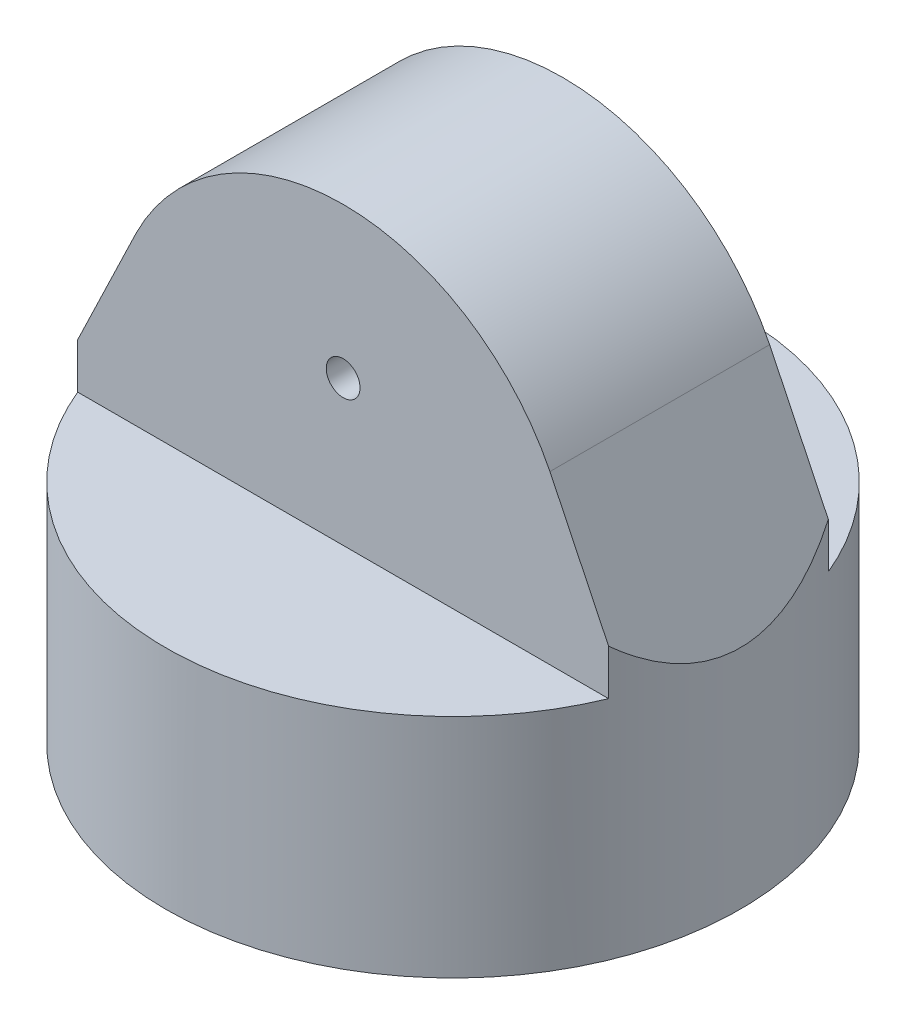
ISO-10303-21;
HEADER;
FILE_DESCRIPTION(('STEP AP214'),'2;1');
FILE_NAME('part.step','',(''),(''),'','','');
FILE_SCHEMA(('AUTOMOTIVE_DESIGN { 1 0 10303 214 1 1 1 1 }'));
ENDSEC;
DATA;
#1=APPLICATION_CONTEXT('core data for automotive mechanical design processes');
#2=APPLICATION_PROTOCOL_DEFINITION('international standard','automotive_design',2000,#1);
#3=PRODUCT_CONTEXT('',#1,'mechanical');
#4=PRODUCT('Part','Part','',(#3));
#5=PRODUCT_RELATED_PRODUCT_CATEGORY('part','',(#4));
#6=PRODUCT_DEFINITION_FORMATION('','',#4);
#7=PRODUCT_DEFINITION_CONTEXT('part definition',#1,'design');
#8=PRODUCT_DEFINITION('design','',#6,#7);
#9=PRODUCT_DEFINITION_SHAPE('','',#8);
#10=(LENGTH_UNIT() NAMED_UNIT(*) SI_UNIT(.MILLI.,.METRE.));
#11=(NAMED_UNIT(*) PLANE_ANGLE_UNIT() SI_UNIT($,.RADIAN.));
#12=(NAMED_UNIT(*) SI_UNIT($,.STERADIAN.) SOLID_ANGLE_UNIT());
#13=UNCERTAINTY_MEASURE_WITH_UNIT(LENGTH_MEASURE(1.E-05),#10,'distance_accuracy_value','');
#14=(GEOMETRIC_REPRESENTATION_CONTEXT(3) GLOBAL_UNCERTAINTY_ASSIGNED_CONTEXT((#13)) GLOBAL_UNIT_ASSIGNED_CONTEXT((#10,
#11,#12)) REPRESENTATION_CONTEXT('',''));
#15=CARTESIAN_POINT('',(0.,0.,0.));
#16=DIRECTION('',(0.,0.,1.));
#17=DIRECTION('',(1.,0.,0.));
#18=AXIS2_PLACEMENT_3D('',#15,#16,#17);
#19=CARTESIAN_POINT('',(0.,35.,0.));
#20=DIRECTION('',(0.,1.,0.));
#21=DIRECTION('',(0.,0.,1.));
#22=AXIS2_PLACEMENT_3D('',#19,#20,#21);
#23=PLANE('',#22);
#24=CARTESIAN_POINT('',(0.,35.,0.));
#25=DIRECTION('',(0.,1.,0.));
#26=DIRECTION('',(0.,0.,1.));
#27=AXIS2_PLACEMENT_3D('',#24,#25,#26);
#28=CIRCLE('',#27,75.);
#29=CARTESIAN_POINT('',(0.,35.,75.));
#30=VERTEX_POINT('',#29);
#31=EDGE_CURVE('E127',#30,#30,#28,.T.);
#32=ORIENTED_EDGE('',*,*,#31,.F.);
#33=EDGE_LOOP('',(#32));
#34=FACE_BOUND('',#33,.T.);
#35=CARTESIAN_POINT('',(15.1000000000001,35.,15.1000000000001));
#36=DIRECTION('',(0.,-1.,0.));
#37=DIRECTION('',(0.,0.,1.));
#38=AXIS2_PLACEMENT_3D('',#35,#36,#37);
#39=CIRCLE('',#38,2.5);
#40=CARTESIAN_POINT('',(17.6000000000001,35.,15.1));
#41=VERTEX_POINT('',#40);
#42=CARTESIAN_POINT('',(15.1,35.,17.6000000000001));
#43=VERTEX_POINT('',#42);
#44=EDGE_CURVE('E275',#41,#43,#39,.T.);
#45=ORIENTED_EDGE('',*,*,#44,.F.);
#46=DIRECTION('',(0.,0.,1.));
#47=VECTOR('',#46,1.);
#48=CARTESIAN_POINT('',(17.6000000000001,35.,-15.1));
#49=LINE('',#48,#47);
#50=CARTESIAN_POINT('',(17.6000000000001,35.,-15.1));
#51=VERTEX_POINT('',#50);
#52=EDGE_CURVE('E153',#51,#41,#49,.T.);
#53=ORIENTED_EDGE('',*,*,#52,.F.);
#54=CARTESIAN_POINT('',(15.1000000000001,35.,-15.1000000000001));
#55=DIRECTION('',(0.,-1.,0.));
#56=DIRECTION('',(0.,0.,-1.));
#57=AXIS2_PLACEMENT_3D('',#54,#55,#56);
#58=CIRCLE('',#57,2.5);
#59=CARTESIAN_POINT('',(15.1,35.,-17.6000000000001));
#60=VERTEX_POINT('',#59);
#61=EDGE_CURVE('E63',#60,#51,#58,.T.);
#62=ORIENTED_EDGE('',*,*,#61,.F.);
#63=DIRECTION('',(1.,0.,0.));
#64=VECTOR('',#63,1.);
#65=CARTESIAN_POINT('',(-15.1,35.,-17.6000000000001));
#66=LINE('',#65,#64);
#67=CARTESIAN_POINT('',(-15.1,35.,-17.6000000000001));
#68=VERTEX_POINT('',#67);
#69=EDGE_CURVE('E334',#68,#60,#66,.T.);
#70=ORIENTED_EDGE('',*,*,#69,.F.);
#71=CARTESIAN_POINT('',(-15.1000000000001,35.,-15.1000000000001));
#72=DIRECTION('',(0.,-1.,0.));
#73=DIRECTION('',(0.,0.,1.));
#74=AXIS2_PLACEMENT_3D('',#71,#72,#73);
#75=CIRCLE('',#74,2.5);
#76=CARTESIAN_POINT('',(-17.6000000000001,35.,-15.1));
#77=VERTEX_POINT('',#76);
#78=EDGE_CURVE('E330',#77,#68,#75,.T.);
#79=ORIENTED_EDGE('',*,*,#78,.F.);
#80=DIRECTION('',(0.,0.,-1.));
#81=VECTOR('',#80,1.);
#82=CARTESIAN_POINT('',(-17.6000000000001,35.,-15.1));
#83=LINE('',#82,#81);
#84=CARTESIAN_POINT('',(-17.6000000000001,35.,15.1));
#85=VERTEX_POINT('',#84);
#86=EDGE_CURVE('E326',#85,#77,#83,.T.);
#87=ORIENTED_EDGE('',*,*,#86,.F.);
#88=CARTESIAN_POINT('',(-15.1000000000001,35.,15.1000000000001));
#89=DIRECTION('',(0.,-1.,0.));
#90=DIRECTION('',(0.,0.,1.));
#91=AXIS2_PLACEMENT_3D('',#88,#89,#90);
#92=CIRCLE('',#91,2.5);
#93=CARTESIAN_POINT('',(-15.1,35.,17.6000000000001));
#94=VERTEX_POINT('',#93);
#95=EDGE_CURVE('E322',#94,#85,#92,.T.);
#96=ORIENTED_EDGE('',*,*,#95,.F.);
#97=DIRECTION('',(-1.,0.,0.));
#98=VECTOR('',#97,1.);
#99=CARTESIAN_POINT('',(-15.1,35.,17.6000000000001));
#100=LINE('',#99,#98);
#101=EDGE_CURVE('E319',#43,#94,#100,.T.);
#102=ORIENTED_EDGE('',*,*,#101,.F.);
#103=EDGE_LOOP('',(#45,#53,#62,#70,#79,#87,#96,#102));
#104=FACE_BOUND('',#103,.T.);
#105=ADVANCED_FACE('F45',(#34,#104),#23,.F.);
#106=CARTESIAN_POINT('',(0.,81.8442212366481,32.5));
#107=DIRECTION('',(0.,0.,-1.));
#108=DIRECTION('',(-1.,0.,0.));
#109=AXIS2_PLACEMENT_3D('',#106,#107,#108);
#110=CYLINDRICAL_SURFACE('',#109,5.);
#111=CARTESIAN_POINT('',(0.,81.8442212366481,-17.6000000000001));
#112=DIRECTION('',(0.,0.,-1.));
#113=DIRECTION('',(-1.,0.,0.));
#114=AXIS2_PLACEMENT_3D('',#111,#112,#113);
#115=CIRCLE('',#114,5.);
#116=CARTESIAN_POINT('',(-5.,81.8442212366481,-17.6000000000001));
#117=VERTEX_POINT('',#116);
#118=EDGE_CURVE('E49',#117,#117,#115,.T.);
#119=ORIENTED_EDGE('',*,*,#118,.F.);
#120=EDGE_LOOP('',(#119));
#121=FACE_BOUND('',#120,.T.);
#122=CARTESIAN_POINT('',(0.,81.8442212366481,-32.5));
#123=DIRECTION('',(0.,0.,1.));
#124=DIRECTION('',(1.,0.,0.));
#125=AXIS2_PLACEMENT_3D('',#122,#123,#124);
#126=CIRCLE('',#125,5.);
#127=CARTESIAN_POINT('',(5.,81.8442212366481,-32.5));
#128=VERTEX_POINT('',#127);
#129=EDGE_CURVE('E197',#128,#128,#126,.T.);
#130=ORIENTED_EDGE('',*,*,#129,.F.);
#131=EDGE_LOOP('',(#130));
#132=FACE_BOUND('',#131,.T.);
#133=ADVANCED_FACE('F357',(#121,#132),#110,.F.);
#134=CARTESIAN_POINT('',(85.,39.,32.5));
#135=DIRECTION('',(-0.901147128098133,-0.433513383323384,0.));
#136=DIRECTION('',(0.433513383323384,-0.901147128098133,0.));
#137=AXIS2_PLACEMENT_3D('',#134,#135,#136);
#138=PLANE('',#137);
#139=CARTESIAN_POINT('',(0.,215.690060410897,0.));
#140=DIRECTION('',(-0.901147128098133,-0.433513383323384,0.));
#141=DIRECTION('',(0.433513383323384,-0.901147128098133,0.));
#142=AXIS2_PLACEMENT_3D('',#139,#140,#141);
#143=ELLIPSE('',#142,196.072378085253,85.);
#144=CARTESIAN_POINT('',(78.5413903620251,52.4255544365199,32.5));
#145=VERTEX_POINT('',#144);
#146=CARTESIAN_POINT('',(78.5413903620251,52.4255544365199,-32.5));
#147=VERTEX_POINT('',#146);
#148=EDGE_CURVE('E185',#145,#147,#143,.F.);
#149=ORIENTED_EDGE('',*,*,#148,.T.);
#150=DIRECTION('',(-0.433513383323384,0.901147128098133,0.));
#151=VECTOR('',#150,1.);
#152=CARTESIAN_POINT('',(85.,39.,-32.5));
#153=LINE('',#152,#151);
#154=CARTESIAN_POINT('',(61.1810003948392,88.5127115195648,-32.5));
#155=VERTEX_POINT('',#154);
#156=EDGE_CURVE('E97',#147,#155,#153,.T.);
#157=ORIENTED_EDGE('',*,*,#156,.T.);
#158=DIRECTION('',(0.,0.,-1.));
#159=VECTOR('',#158,1.);
#160=CARTESIAN_POINT('',(61.1810003948392,88.5127115195648,32.5));
#161=LINE('',#160,#159);
#162=CARTESIAN_POINT('',(61.1810003948392,88.5127115195648,32.5));
#163=VERTEX_POINT('',#162);
#164=EDGE_CURVE('E91',#163,#155,#161,.T.);
#165=ORIENTED_EDGE('',*,*,#164,.F.);
#166=DIRECTION('',(-0.433513383323384,0.901147128098133,0.));
#167=VECTOR('',#166,1.);
#168=CARTESIAN_POINT('',(85.,39.,32.5));
#169=LINE('',#168,#167);
#170=EDGE_CURVE('E114',#145,#163,#169,.T.);
#171=ORIENTED_EDGE('',*,*,#170,.F.);
#172=EDGE_LOOP('',(#149,#157,#165,#171));
#173=FACE_BOUND('',#172,.T.);
#174=ADVANCED_FACE('F216',(#173),#138,.F.);
#175=CARTESIAN_POINT('',(-85.,39.,32.5));
#176=DIRECTION('',(0.901147128098133,-0.433513383323384,0.));
#177=DIRECTION('',(0.433513383323384,0.901147128098133,0.));
#178=AXIS2_PLACEMENT_3D('',#175,#176,#177);
#179=PLANE('',#178);
#180=CARTESIAN_POINT('',(0.,215.690060410897,0.));
#181=DIRECTION('',(0.901147128098133,-0.433513383323384,0.));
#182=DIRECTION('',(-0.433513383323384,-0.901147128098133,0.));
#183=AXIS2_PLACEMENT_3D('',#180,#181,#182);
#184=ELLIPSE('',#183,196.072378085253,85.);
#185=CARTESIAN_POINT('',(-78.5413903620251,52.4255544365199,-32.5));
#186=VERTEX_POINT('',#185);
#187=CARTESIAN_POINT('',(-78.5413903620251,52.4255544365199,32.5));
#188=VERTEX_POINT('',#187);
#189=EDGE_CURVE('E11',#186,#188,#184,.F.);
#190=ORIENTED_EDGE('',*,*,#189,.T.);
#191=DIRECTION('',(-0.433513383323384,-0.901147128098133,0.));
#192=VECTOR('',#191,1.);
#193=CARTESIAN_POINT('',(-85.,39.,32.5));
#194=LINE('',#193,#192);
#195=CARTESIAN_POINT('',(-61.1810003948392,88.5127115195647,32.5));
#196=VERTEX_POINT('',#195);
#197=EDGE_CURVE('E103',#196,#188,#194,.T.);
#198=ORIENTED_EDGE('',*,*,#197,.F.);
#199=DIRECTION('',(0.,0.,-1.));
#200=VECTOR('',#199,1.);
#201=CARTESIAN_POINT('',(-61.1810003948392,88.5127115195647,32.5));
#202=LINE('',#201,#200);
#203=CARTESIAN_POINT('',(-61.1810003948392,88.5127115195647,-32.5));
#204=VERTEX_POINT('',#203);
#205=EDGE_CURVE('E88',#196,#204,#202,.T.);
#206=ORIENTED_EDGE('',*,*,#205,.T.);
#207=DIRECTION('',(-0.433513383323384,-0.901147128098133,0.));
#208=VECTOR('',#207,1.);
#209=CARTESIAN_POINT('',(-85.,39.,-32.5));
#210=LINE('',#209,#208);
#211=EDGE_CURVE('E96',#204,#186,#210,.T.);
#212=ORIENTED_EDGE('',*,*,#211,.T.);
#213=EDGE_LOOP('',(#190,#198,#206,#212));
#214=FACE_BOUND('',#213,.T.);
#215=ADVANCED_FACE('F101',(#214),#179,.F.);
#216=CARTESIAN_POINT('',(0.,39.,0.));
#217=DIRECTION('',(0.,1.,0.));
#218=DIRECTION('',(0.,0.,1.));
#219=AXIS2_PLACEMENT_3D('',#216,#217,#218);
#220=PLANE('',#219);
#221=CARTESIAN_POINT('',(0.,39.,0.));
#222=DIRECTION('',(0.,1.,0.));
#223=DIRECTION('',(0.,0.,1.));
#224=AXIS2_PLACEMENT_3D('',#221,#222,#223);
#225=CIRCLE('',#224,85.);
#226=CARTESIAN_POINT('',(78.5413903620251,39.,-32.5));
#227=VERTEX_POINT('',#226);
#228=CARTESIAN_POINT('',(-78.5413903620251,39.,-32.5));
#229=VERTEX_POINT('',#228);
#230=EDGE_CURVE('E126',#227,#229,#225,.T.);
#231=ORIENTED_EDGE('',*,*,#230,.T.);
#232=DIRECTION('',(1.,0.,0.));
#233=VECTOR('',#232,1.);
#234=CARTESIAN_POINT('',(-85.,39.,-32.5));
#235=LINE('',#234,#233);
#236=EDGE_CURVE('E55',#229,#227,#235,.T.);
#237=ORIENTED_EDGE('',*,*,#236,.T.);
#238=EDGE_LOOP('',(#231,#237));
#239=FACE_BOUND('',#238,.T.);
#240=ADVANCED_FACE('F379',(#239),#220,.T.);
#241=CARTESIAN_POINT('',(0.,35.,0.));
#242=DIRECTION('',(0.,-1.,0.));
#243=DIRECTION('',(0.,0.,-1.));
#244=AXIS2_PLACEMENT_3D('',#241,#242,#243);
#245=CYLINDRICAL_SURFACE('',#244,85.);
#246=DIRECTION('',(0.,-1.,0.));
#247=VECTOR('',#246,1.);
#248=CARTESIAN_POINT('',(78.5413903620251,106.,-32.5));
#249=LINE('',#248,#247);
#250=EDGE_CURVE('E189',#227,#147,#249,.F.);
#251=ORIENTED_EDGE('',*,*,#250,.T.);
#252=ORIENTED_EDGE('',*,*,#148,.F.);
#253=DIRECTION('',(0.,-1.,0.));
#254=VECTOR('',#253,1.);
#255=CARTESIAN_POINT('',(78.5413903620251,106.,32.5));
#256=LINE('',#255,#254);
#257=CARTESIAN_POINT('',(78.5413903620251,39.,32.5));
#258=VERTEX_POINT('',#257);
#259=EDGE_CURVE('E193',#258,#145,#256,.F.);
#260=ORIENTED_EDGE('',*,*,#259,.F.);
#261=CARTESIAN_POINT('',(-78.5413903620251,39.,32.5));
#262=VERTEX_POINT('',#261);
#263=EDGE_CURVE('E122',#262,#258,#225,.T.);
#264=ORIENTED_EDGE('',*,*,#263,.F.);
#265=DIRECTION('',(0.,-1.,0.));
#266=VECTOR('',#265,1.);
#267=CARTESIAN_POINT('',(-78.5413903620251,106.,32.5));
#268=LINE('',#267,#266);
#269=EDGE_CURVE('E181',#188,#262,#268,.T.);
#270=ORIENTED_EDGE('',*,*,#269,.F.);
#271=ORIENTED_EDGE('',*,*,#189,.F.);
#272=DIRECTION('',(0.,-1.,0.));
#273=VECTOR('',#272,1.);
#274=CARTESIAN_POINT('',(-78.5413903620251,106.,-32.5));
#275=LINE('',#274,#273);
#276=EDGE_CURVE('E112',#186,#229,#275,.T.);
#277=ORIENTED_EDGE('',*,*,#276,.T.);
#278=ORIENTED_EDGE('',*,*,#230,.F.);
#279=EDGE_LOOP('',(#251,#252,#260,#264,#270,#271,#277,#278));
#280=FACE_BOUND('',#279,.T.);
#281=CARTESIAN_POINT('',(0.,-28.,0.));
#282=DIRECTION('',(0.,-1.,0.));
#283=DIRECTION('',(0.,0.,-1.));
#284=AXIS2_PLACEMENT_3D('',#281,#282,#283);
#285=CIRCLE('',#284,85.);
#286=CARTESIAN_POINT('',(0.,-28.,-85.));
#287=VERTEX_POINT('',#286);
#288=EDGE_CURVE('E295',#287,#287,#285,.T.);
#289=ORIENTED_EDGE('',*,*,#288,.F.);
#290=EDGE_LOOP('',(#289));
#291=FACE_BOUND('',#290,.T.);
#292=ADVANCED_FACE('F47',(#280,#291),#245,.T.);
#293=CARTESIAN_POINT('',(0.,35.,0.));
#294=DIRECTION('',(0.,-1.,0.));
#295=DIRECTION('',(0.,0.,-1.));
#296=AXIS2_PLACEMENT_3D('',#293,#294,#295);
#297=CYLINDRICAL_SURFACE('',#296,75.);
#298=ORIENTED_EDGE('',*,*,#31,.T.);
#299=EDGE_LOOP('',(#298));
#300=FACE_BOUND('',#299,.T.);
#301=CARTESIAN_POINT('',(0.,-28.,0.));
#302=DIRECTION('',(0.,-1.,0.));
#303=DIRECTION('',(0.,0.,-1.));
#304=AXIS2_PLACEMENT_3D('',#301,#302,#303);
#305=CIRCLE('',#304,75.);
#306=CARTESIAN_POINT('',(0.,-28.,-75.));
#307=VERTEX_POINT('',#306);
#308=EDGE_CURVE('E341',#307,#307,#305,.T.);
#309=ORIENTED_EDGE('',*,*,#308,.T.);
#310=EDGE_LOOP('',(#309));
#311=FACE_BOUND('',#310,.T.);
#312=ADVANCED_FACE('F345',(#300,#311),#297,.F.);
#313=DIRECTION('',(1.,0.,0.));
#314=VECTOR('',#313,1.);
#315=CARTESIAN_POINT('',(-85.,39.,32.5));
#316=LINE('',#315,#314);
#317=EDGE_CURVE('E130',#262,#258,#316,.T.);
#318=ORIENTED_EDGE('',*,*,#317,.F.);
#319=ORIENTED_EDGE('',*,*,#263,.T.);
#320=EDGE_LOOP('',(#318,#319));
#321=FACE_BOUND('',#320,.T.);
#322=ADVANCED_FACE('F370',(#321),#220,.T.);
#323=CARTESIAN_POINT('',(0.,58.0345985021707,32.5));
#324=DIRECTION('',(0.,0.,-1.));
#325=DIRECTION('',(-1.,0.,0.));
#326=AXIS2_PLACEMENT_3D('',#323,#324,#325);
#327=PLANE('',#326);
#328=ORIENTED_EDGE('',*,*,#317,.T.);
#329=ORIENTED_EDGE('',*,*,#259,.T.);
#330=ORIENTED_EDGE('',*,*,#170,.T.);
#331=CARTESIAN_POINT('',(0.,58.0345985021707,32.5));
#332=DIRECTION('',(0.,0.,1.));
#333=DIRECTION('',(-1.,0.,0.));
#334=AXIS2_PLACEMENT_3D('',#331,#332,#333);
#335=CIRCLE('',#334,68.3522507487088);
#336=EDGE_CURVE('E72',#163,#196,#335,.T.);
#337=ORIENTED_EDGE('',*,*,#336,.T.);
#338=ORIENTED_EDGE('',*,*,#197,.T.);
#339=ORIENTED_EDGE('',*,*,#269,.T.);
#340=EDGE_LOOP('',(#328,#329,#330,#337,#338,#339));
#341=FACE_BOUND('',#340,.T.);
#342=CARTESIAN_POINT('',(0.,81.8442212366481,32.5));
#343=DIRECTION('',(0.,0.,1.));
#344=DIRECTION('',(1.,0.,0.));
#345=AXIS2_PLACEMENT_3D('',#342,#343,#344);
#346=CIRCLE('',#345,5.);
#347=CARTESIAN_POINT('',(5.,81.8442212366481,32.5));
#348=VERTEX_POINT('',#347);
#349=EDGE_CURVE('E198',#348,#348,#346,.T.);
#350=ORIENTED_EDGE('',*,*,#349,.F.);
#351=EDGE_LOOP('',(#350));
#352=FACE_BOUND('',#351,.T.);
#353=ADVANCED_FACE('F377',(#341,#352),#327,.F.);
#354=CARTESIAN_POINT('',(0.,58.0345985021707,-32.5));
#355=DIRECTION('',(0.,0.,-1.));
#356=DIRECTION('',(-1.,0.,0.));
#357=AXIS2_PLACEMENT_3D('',#354,#355,#356);
#358=PLANE('',#357);
#359=ORIENTED_EDGE('',*,*,#250,.F.);
#360=ORIENTED_EDGE('',*,*,#236,.F.);
#361=ORIENTED_EDGE('',*,*,#276,.F.);
#362=ORIENTED_EDGE('',*,*,#211,.F.);
#363=CARTESIAN_POINT('',(0.,58.0345985021707,-32.5));
#364=DIRECTION('',(0.,0.,1.));
#365=DIRECTION('',(-1.,0.,0.));
#366=AXIS2_PLACEMENT_3D('',#363,#364,#365);
#367=CIRCLE('',#366,68.3522507487088);
#368=EDGE_CURVE('E85',#155,#204,#367,.T.);
#369=ORIENTED_EDGE('',*,*,#368,.F.);
#370=ORIENTED_EDGE('',*,*,#156,.F.);
#371=EDGE_LOOP('',(#359,#360,#361,#362,#369,#370));
#372=FACE_BOUND('',#371,.T.);
#373=ORIENTED_EDGE('',*,*,#129,.T.);
#374=EDGE_LOOP('',(#373));
#375=FACE_BOUND('',#374,.T.);
#376=ADVANCED_FACE('F108',(#372,#375),#358,.T.);
#377=CARTESIAN_POINT('',(0.,58.0345985021707,32.5));
#378=DIRECTION('',(0.,0.,-1.));
#379=DIRECTION('',(-1.,0.,0.));
#380=AXIS2_PLACEMENT_3D('',#377,#378,#379);
#381=CYLINDRICAL_SURFACE('',#380,68.3522507487088);
#382=ORIENTED_EDGE('',*,*,#368,.T.);
#383=ORIENTED_EDGE('',*,*,#205,.F.);
#384=ORIENTED_EDGE('',*,*,#336,.F.);
#385=ORIENTED_EDGE('',*,*,#164,.T.);
#386=EDGE_LOOP('',(#382,#383,#384,#385));
#387=FACE_BOUND('',#386,.T.);
#388=ADVANCED_FACE('F87',(#387),#381,.T.);
#389=CARTESIAN_POINT('',(0.,81.8442212366481,17.6000000000001));
#390=DIRECTION('',(0.,0.,1.));
#391=DIRECTION('',(1.,0.,0.));
#392=AXIS2_PLACEMENT_3D('',#389,#390,#391);
#393=CIRCLE('',#392,5.);
#394=CARTESIAN_POINT('',(5.,81.8442212366481,17.6000000000001));
#395=VERTEX_POINT('',#394);
#396=EDGE_CURVE('E131',#395,#395,#393,.T.);
#397=ORIENTED_EDGE('',*,*,#396,.F.);
#398=EDGE_LOOP('',(#397));
#399=FACE_BOUND('',#398,.T.);
#400=ORIENTED_EDGE('',*,*,#349,.T.);
#401=EDGE_LOOP('',(#400));
#402=FACE_BOUND('',#401,.T.);
#403=ADVANCED_FACE('F366',(#399,#402),#110,.F.);
#404=CARTESIAN_POINT('',(15.1000000000001,93.,15.1000000000001));
#405=DIRECTION('',(0.,-1.,0.));
#406=DIRECTION('',(0.,0.,-1.));
#407=AXIS2_PLACEMENT_3D('',#404,#405,#406);
#408=CYLINDRICAL_SURFACE('',#407,2.5);
#409=ORIENTED_EDGE('',*,*,#44,.T.);
#410=DIRECTION('',(0.,-1.,0.));
#411=VECTOR('',#410,1.);
#412=CARTESIAN_POINT('',(15.1,93.,17.6000000000001));
#413=LINE('',#412,#411);
#414=CARTESIAN_POINT('',(15.1,93.,17.6000000000001));
#415=VERTEX_POINT('',#414);
#416=EDGE_CURVE('E174',#415,#43,#413,.T.);
#417=ORIENTED_EDGE('',*,*,#416,.F.);
#418=CARTESIAN_POINT('',(15.1000000000001,93.,15.1000000000001));
#419=DIRECTION('',(0.,-1.,0.));
#420=DIRECTION('',(0.,0.,1.));
#421=AXIS2_PLACEMENT_3D('',#418,#419,#420);
#422=CIRCLE('',#421,2.5);
#423=CARTESIAN_POINT('',(17.6000000000001,93.,15.1));
#424=VERTEX_POINT('',#423);
#425=EDGE_CURVE('E272',#424,#415,#422,.T.);
#426=ORIENTED_EDGE('',*,*,#425,.F.);
#427=DIRECTION('',(0.,-1.,0.));
#428=VECTOR('',#427,1.);
#429=CARTESIAN_POINT('',(17.6000000000001,93.,15.1));
#430=LINE('',#429,#428);
#431=EDGE_CURVE('E134',#424,#41,#430,.T.);
#432=ORIENTED_EDGE('',*,*,#431,.T.);
#433=EDGE_LOOP('',(#409,#417,#426,#432));
#434=FACE_BOUND('',#433,.T.);
#435=ADVANCED_FACE('F270',(#434),#408,.F.);
#436=CARTESIAN_POINT('',(17.6000000000001,93.,-15.1));
#437=DIRECTION('',(1.,0.,0.));
#438=DIRECTION('',(0.,0.,-1.));
#439=AXIS2_PLACEMENT_3D('',#436,#437,#438);
#440=PLANE('',#439);
#441=ORIENTED_EDGE('',*,*,#52,.T.);
#442=ORIENTED_EDGE('',*,*,#431,.F.);
#443=DIRECTION('',(0.,0.,1.));
#444=VECTOR('',#443,1.);
#445=CARTESIAN_POINT('',(17.6000000000001,93.,-15.1));
#446=LINE('',#445,#444);
#447=CARTESIAN_POINT('',(17.6000000000001,93.,-15.1));
#448=VERTEX_POINT('',#447);
#449=EDGE_CURVE('E178',#448,#424,#446,.T.);
#450=ORIENTED_EDGE('',*,*,#449,.F.);
#451=DIRECTION('',(0.,-1.,0.));
#452=VECTOR('',#451,1.);
#453=CARTESIAN_POINT('',(17.6000000000001,93.,-15.1));
#454=LINE('',#453,#452);
#455=EDGE_CURVE('E141',#448,#51,#454,.T.);
#456=ORIENTED_EDGE('',*,*,#455,.T.);
#457=EDGE_LOOP('',(#441,#442,#450,#456));
#458=FACE_BOUND('',#457,.T.);
#459=ADVANCED_FACE('F403',(#458),#440,.F.);
#460=CARTESIAN_POINT('',(15.1000000000001,93.,-15.1000000000001));
#461=DIRECTION('',(0.,-1.,0.));
#462=DIRECTION('',(0.,0.,-1.));
#463=AXIS2_PLACEMENT_3D('',#460,#461,#462);
#464=CYLINDRICAL_SURFACE('',#463,2.5);
#465=ORIENTED_EDGE('',*,*,#61,.T.);
#466=ORIENTED_EDGE('',*,*,#455,.F.);
#467=CARTESIAN_POINT('',(15.1000000000001,93.,-15.1000000000001));
#468=DIRECTION('',(0.,-1.,0.));
#469=DIRECTION('',(0.,0.,-1.));
#470=AXIS2_PLACEMENT_3D('',#467,#468,#469);
#471=CIRCLE('',#470,2.5);
#472=CARTESIAN_POINT('',(15.1,93.,-17.6000000000001));
#473=VERTEX_POINT('',#472);
#474=EDGE_CURVE('E312',#473,#448,#471,.T.);
#475=ORIENTED_EDGE('',*,*,#474,.F.);
#476=DIRECTION('',(0.,-1.,0.));
#477=VECTOR('',#476,1.);
#478=CARTESIAN_POINT('',(15.1,93.,-17.6000000000001));
#479=LINE('',#478,#477);
#480=EDGE_CURVE('E150',#473,#60,#479,.T.);
#481=ORIENTED_EDGE('',*,*,#480,.T.);
#482=EDGE_LOOP('',(#465,#466,#475,#481));
#483=FACE_BOUND('',#482,.T.);
#484=ADVANCED_FACE('F477',(#483),#464,.F.);
#485=CARTESIAN_POINT('',(-15.1,93.,-17.6000000000001));
#486=DIRECTION('',(0.,0.,-1.));
#487=DIRECTION('',(-1.,0.,0.));
#488=AXIS2_PLACEMENT_3D('',#485,#486,#487);
#489=PLANE('',#488);
#490=ORIENTED_EDGE('',*,*,#118,.T.);
#491=EDGE_LOOP('',(#490));
#492=FACE_BOUND('',#491,.T.);
#493=ORIENTED_EDGE('',*,*,#69,.T.);
#494=ORIENTED_EDGE('',*,*,#480,.F.);
#495=DIRECTION('',(1.,0.,0.));
#496=VECTOR('',#495,1.);
#497=CARTESIAN_POINT('',(-15.1,93.,-17.6000000000001));
#498=LINE('',#497,#496);
#499=CARTESIAN_POINT('',(-15.1,93.,-17.6000000000001));
#500=VERTEX_POINT('',#499);
#501=EDGE_CURVE('E308',#500,#473,#498,.T.);
#502=ORIENTED_EDGE('',*,*,#501,.F.);
#503=DIRECTION('',(0.,-1.,0.));
#504=VECTOR('',#503,1.);
#505=CARTESIAN_POINT('',(-15.1,93.,-17.6000000000001));
#506=LINE('',#505,#504);
#507=EDGE_CURVE('E158',#500,#68,#506,.T.);
#508=ORIENTED_EDGE('',*,*,#507,.T.);
#509=EDGE_LOOP('',(#493,#494,#502,#508));
#510=FACE_BOUND('',#509,.T.);
#511=ADVANCED_FACE('F486',(#492,#510),#489,.F.);
#512=CARTESIAN_POINT('',(-15.1000000000001,93.,-15.1000000000001));
#513=DIRECTION('',(0.,-1.,0.));
#514=DIRECTION('',(0.,0.,-1.));
#515=AXIS2_PLACEMENT_3D('',#512,#513,#514);
#516=CYLINDRICAL_SURFACE('',#515,2.5);
#517=ORIENTED_EDGE('',*,*,#78,.T.);
#518=ORIENTED_EDGE('',*,*,#507,.F.);
#519=CARTESIAN_POINT('',(-15.1000000000001,93.,-15.1000000000001));
#520=DIRECTION('',(0.,-1.,0.));
#521=DIRECTION('',(0.,0.,1.));
#522=AXIS2_PLACEMENT_3D('',#519,#520,#521);
#523=CIRCLE('',#522,2.5);
#524=CARTESIAN_POINT('',(-17.6000000000001,93.,-15.1));
#525=VERTEX_POINT('',#524);
#526=EDGE_CURVE('E304',#525,#500,#523,.T.);
#527=ORIENTED_EDGE('',*,*,#526,.F.);
#528=DIRECTION('',(0.,-1.,0.));
#529=VECTOR('',#528,1.);
#530=CARTESIAN_POINT('',(-17.6000000000001,93.,-15.1));
#531=LINE('',#530,#529);
#532=EDGE_CURVE('E162',#525,#77,#531,.T.);
#533=ORIENTED_EDGE('',*,*,#532,.T.);
#534=EDGE_LOOP('',(#517,#518,#527,#533));
#535=FACE_BOUND('',#534,.T.);
#536=ADVANCED_FACE('F494',(#535),#516,.F.);
#537=CARTESIAN_POINT('',(-17.6000000000001,93.,-15.1));
#538=DIRECTION('',(-1.,0.,0.));
#539=DIRECTION('',(0.,0.,1.));
#540=AXIS2_PLACEMENT_3D('',#537,#538,#539);
#541=PLANE('',#540);
#542=ORIENTED_EDGE('',*,*,#86,.T.);
#543=ORIENTED_EDGE('',*,*,#532,.F.);
#544=DIRECTION('',(0.,0.,-1.));
#545=VECTOR('',#544,1.);
#546=CARTESIAN_POINT('',(-17.6000000000001,93.,-15.1));
#547=LINE('',#546,#545);
#548=CARTESIAN_POINT('',(-17.6000000000001,93.,15.1));
#549=VERTEX_POINT('',#548);
#550=EDGE_CURVE('E300',#549,#525,#547,.T.);
#551=ORIENTED_EDGE('',*,*,#550,.F.);
#552=DIRECTION('',(0.,-1.,0.));
#553=VECTOR('',#552,1.);
#554=CARTESIAN_POINT('',(-17.6000000000001,93.,15.1));
#555=LINE('',#554,#553);
#556=EDGE_CURVE('E166',#549,#85,#555,.T.);
#557=ORIENTED_EDGE('',*,*,#556,.T.);
#558=EDGE_LOOP('',(#542,#543,#551,#557));
#559=FACE_BOUND('',#558,.T.);
#560=ADVANCED_FACE('F503',(#559),#541,.F.);
#561=CARTESIAN_POINT('',(-15.1000000000001,93.,15.1000000000001));
#562=DIRECTION('',(0.,-1.,0.));
#563=DIRECTION('',(0.,0.,-1.));
#564=AXIS2_PLACEMENT_3D('',#561,#562,#563);
#565=CYLINDRICAL_SURFACE('',#564,2.5);
#566=ORIENTED_EDGE('',*,*,#95,.T.);
#567=ORIENTED_EDGE('',*,*,#556,.F.);
#568=CARTESIAN_POINT('',(-15.1000000000001,93.,15.1000000000001));
#569=DIRECTION('',(0.,-1.,0.));
#570=DIRECTION('',(0.,0.,1.));
#571=AXIS2_PLACEMENT_3D('',#568,#569,#570);
#572=CIRCLE('',#571,2.5);
#573=CARTESIAN_POINT('',(-15.1,93.,17.6000000000001));
#574=VERTEX_POINT('',#573);
#575=EDGE_CURVE('E286',#574,#549,#572,.T.);
#576=ORIENTED_EDGE('',*,*,#575,.F.);
#577=DIRECTION('',(0.,-1.,0.));
#578=VECTOR('',#577,1.);
#579=CARTESIAN_POINT('',(-15.1,93.,17.6000000000001));
#580=LINE('',#579,#578);
#581=EDGE_CURVE('E170',#574,#94,#580,.T.);
#582=ORIENTED_EDGE('',*,*,#581,.T.);
#583=EDGE_LOOP('',(#566,#567,#576,#582));
#584=FACE_BOUND('',#583,.T.);
#585=ADVANCED_FACE('F512',(#584),#565,.F.);
#586=CARTESIAN_POINT('',(-15.1,93.,17.6000000000001));
#587=DIRECTION('',(0.,0.,1.));
#588=DIRECTION('',(1.,0.,0.));
#589=AXIS2_PLACEMENT_3D('',#586,#587,#588);
#590=PLANE('',#589);
#591=ORIENTED_EDGE('',*,*,#396,.T.);
#592=EDGE_LOOP('',(#591));
#593=FACE_BOUND('',#592,.T.);
#594=ORIENTED_EDGE('',*,*,#101,.T.);
#595=ORIENTED_EDGE('',*,*,#581,.F.);
#596=DIRECTION('',(-1.,0.,0.));
#597=VECTOR('',#596,1.);
#598=CARTESIAN_POINT('',(-15.1,93.,17.6000000000001));
#599=LINE('',#598,#597);
#600=EDGE_CURVE('E280',#415,#574,#599,.T.);
#601=ORIENTED_EDGE('',*,*,#600,.F.);
#602=ORIENTED_EDGE('',*,*,#416,.T.);
#603=EDGE_LOOP('',(#594,#595,#601,#602));
#604=FACE_BOUND('',#603,.T.);
#605=ADVANCED_FACE('F281',(#593,#604),#590,.F.);
#606=CARTESIAN_POINT('',(15.1000000000001,93.,15.1000000000001));
#607=DIRECTION('',(0.,1.,0.));
#608=DIRECTION('',(0.,0.,1.));
#609=AXIS2_PLACEMENT_3D('',#606,#607,#608);
#610=PLANE('',#609);
#611=ORIENTED_EDGE('',*,*,#425,.T.);
#612=ORIENTED_EDGE('',*,*,#600,.T.);
#613=ORIENTED_EDGE('',*,*,#575,.T.);
#614=ORIENTED_EDGE('',*,*,#550,.T.);
#615=ORIENTED_EDGE('',*,*,#526,.T.);
#616=ORIENTED_EDGE('',*,*,#501,.T.);
#617=ORIENTED_EDGE('',*,*,#474,.T.);
#618=ORIENTED_EDGE('',*,*,#449,.T.);
#619=EDGE_LOOP('',(#611,#612,#613,#614,#615,#616,#617,#618));
#620=FACE_BOUND('',#619,.T.);
#621=ADVANCED_FACE('F288',(#620),#610,.F.);
#622=CARTESIAN_POINT('',(0.,-28.,0.));
#623=DIRECTION('',(0.,-1.,0.));
#624=DIRECTION('',(0.,0.,-1.));
#625=AXIS2_PLACEMENT_3D('',#622,#623,#624);
#626=PLANE('',#625);
#627=ORIENTED_EDGE('',*,*,#288,.T.);
#628=EDGE_LOOP('',(#627));
#629=FACE_BOUND('',#628,.T.);
#630=ORIENTED_EDGE('',*,*,#308,.F.);
#631=EDGE_LOOP('',(#630));
#632=FACE_BOUND('',#631,.T.);
#633=ADVANCED_FACE('F347',(#629,#632),#626,.T.);
#634=CLOSED_SHELL('',(#105,#133,#174,#215,#240,#292,#312,#322,#353,#376,#388,#403,#435,#459,
#484,#511,#536,#560,#585,#605,#621,#633));
#635=MANIFOLD_SOLID_BREP('B2',#634);
#636=ADVANCED_BREP_SHAPE_REPRESENTATION('',(#18,#635),#14);
#637=SHAPE_DEFINITION_REPRESENTATION(#9,#636);
ENDSEC;
END-ISO-10303-21;
